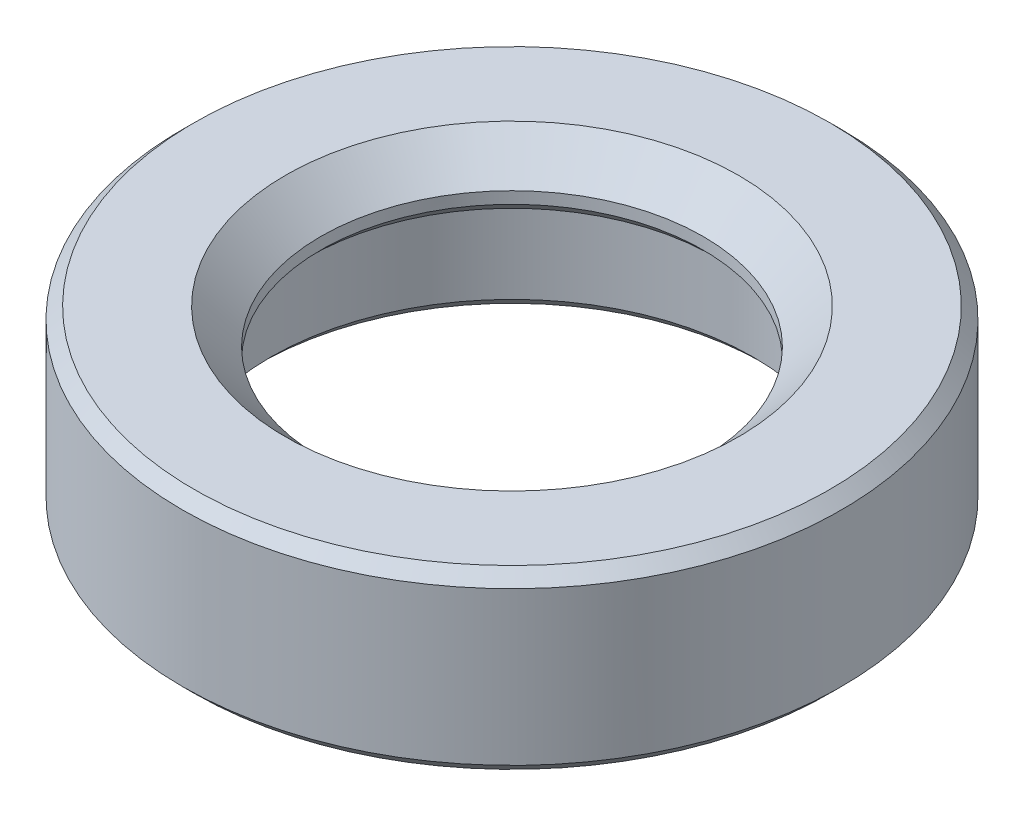
ISO-10303-21;
HEADER;
FILE_DESCRIPTION(('STEP AP214'),'2;1');
FILE_NAME('part.step','',(''),(''),'','','');
FILE_SCHEMA(('AUTOMOTIVE_DESIGN { 1 0 10303 214 1 1 1 1 }'));
ENDSEC;
DATA;
#1=APPLICATION_CONTEXT('core data for automotive mechanical design processes');
#2=APPLICATION_PROTOCOL_DEFINITION('international standard','automotive_design',2000,#1);
#3=PRODUCT_CONTEXT('',#1,'mechanical');
#4=PRODUCT('Part','Part','',(#3));
#5=PRODUCT_RELATED_PRODUCT_CATEGORY('part','',(#4));
#6=PRODUCT_DEFINITION_FORMATION('','',#4);
#7=PRODUCT_DEFINITION_CONTEXT('part definition',#1,'design');
#8=PRODUCT_DEFINITION('design','',#6,#7);
#9=PRODUCT_DEFINITION_SHAPE('','',#8);
#10=(LENGTH_UNIT() NAMED_UNIT(*) SI_UNIT(.MILLI.,.METRE.));
#11=(NAMED_UNIT(*) PLANE_ANGLE_UNIT() SI_UNIT($,.RADIAN.));
#12=(NAMED_UNIT(*) SI_UNIT($,.STERADIAN.) SOLID_ANGLE_UNIT());
#13=UNCERTAINTY_MEASURE_WITH_UNIT(LENGTH_MEASURE(1.E-05),#10,'distance_accuracy_value','');
#14=(GEOMETRIC_REPRESENTATION_CONTEXT(3) GLOBAL_UNCERTAINTY_ASSIGNED_CONTEXT((#13)) GLOBAL_UNIT_ASSIGNED_CONTEXT((#10,
#11,#12)) REPRESENTATION_CONTEXT('',''));
#15=CARTESIAN_POINT('',(0.,0.,0.));
#16=DIRECTION('',(0.,0.,1.));
#17=DIRECTION('',(1.,0.,0.));
#18=AXIS2_PLACEMENT_3D('',#15,#16,#17);
#19=CARTESIAN_POINT('',(0.,-1.5,-5.6));
#20=DIRECTION('',(0.,1.,0.));
#21=DIRECTION('',(0.,0.,1.));
#22=AXIS2_PLACEMENT_3D('',#19,#20,#21);
#23=PLANE('',#22);
#24=CARTESIAN_POINT('',(0.,-1.5,0.));
#25=DIRECTION('',(0.,1.,0.));
#26=DIRECTION('',(0.,0.,1.));
#27=AXIS2_PLACEMENT_3D('',#24,#25,#26);
#28=CIRCLE('',#27,4.3);
#29=CARTESIAN_POINT('',(0.,-1.5,4.3));
#30=VERTEX_POINT('',#29);
#31=EDGE_CURVE('E57',#30,#30,#28,.T.);
#32=ORIENTED_EDGE('',*,*,#31,.T.);
#33=EDGE_LOOP('',(#32));
#34=FACE_BOUND('',#33,.T.);
#35=CARTESIAN_POINT('',(0.,-1.5,0.));
#36=DIRECTION('',(0.,1.,0.));
#37=DIRECTION('',(0.,0.,1.));
#38=AXIS2_PLACEMENT_3D('',#35,#36,#37);
#39=CIRCLE('',#38,5.4);
#40=CARTESIAN_POINT('',(0.,-1.5,5.4));
#41=VERTEX_POINT('',#40);
#42=EDGE_CURVE('E60',#41,#41,#39,.F.);
#43=ORIENTED_EDGE('',*,*,#42,.T.);
#44=EDGE_LOOP('',(#43));
#45=FACE_BOUND('',#44,.T.);
#46=ADVANCED_FACE('F31',(#34,#45),#23,.F.);
#47=CARTESIAN_POINT('',(0.,14.1930379746836,0.));
#48=DIRECTION('',(0.,1.,0.));
#49=DIRECTION('',(0.,0.,1.));
#50=AXIS2_PLACEMENT_3D('',#47,#48,#49);
#51=CYLINDRICAL_SURFACE('',#50,4.1);
#52=CARTESIAN_POINT('',(0.,-1.3,0.));
#53=DIRECTION('',(0.,1.,0.));
#54=DIRECTION('',(0.,0.,1.));
#55=AXIS2_PLACEMENT_3D('',#52,#53,#54);
#56=CIRCLE('',#55,4.1);
#57=CARTESIAN_POINT('',(0.,-1.3,4.1));
#58=VERTEX_POINT('',#57);
#59=EDGE_CURVE('E54',#58,#58,#56,.F.);
#60=ORIENTED_EDGE('',*,*,#59,.T.);
#61=EDGE_LOOP('',(#60));
#62=FACE_BOUND('',#61,.T.);
#63=CARTESIAN_POINT('',(0.,0.5,0.));
#64=DIRECTION('',(0.,1.,0.));
#65=DIRECTION('',(0.,0.,1.));
#66=AXIS2_PLACEMENT_3D('',#63,#64,#65);
#67=CIRCLE('',#66,4.1);
#68=CARTESIAN_POINT('',(0.,0.5,4.1));
#69=VERTEX_POINT('',#68);
#70=EDGE_CURVE('E69',#69,#69,#67,.T.);
#71=ORIENTED_EDGE('',*,*,#70,.T.);
#72=EDGE_LOOP('',(#71));
#73=FACE_BOUND('',#72,.T.);
#74=ADVANCED_FACE('F73',(#62,#73),#51,.F.);
#75=CARTESIAN_POINT('',(0.,0.5,-4.1));
#76=DIRECTION('',(0.,1.,0.));
#77=DIRECTION('',(0.,0.,1.));
#78=AXIS2_PLACEMENT_3D('',#75,#76,#77);
#79=PLANE('',#78);
#80=CARTESIAN_POINT('',(0.,0.5,0.));
#81=DIRECTION('',(0.,1.,0.));
#82=DIRECTION('',(0.,0.,1.));
#83=AXIS2_PLACEMENT_3D('',#80,#81,#82);
#84=CIRCLE('',#83,3.45);
#85=CARTESIAN_POINT('',(0.,0.5,3.45));
#86=VERTEX_POINT('',#85);
#87=EDGE_CURVE('E66',#86,#86,#84,.T.);
#88=ORIENTED_EDGE('',*,*,#87,.T.);
#89=EDGE_LOOP('',(#88));
#90=FACE_BOUND('',#89,.T.);
#91=ORIENTED_EDGE('',*,*,#70,.F.);
#92=EDGE_LOOP('',(#91));
#93=FACE_BOUND('',#92,.T.);
#94=ADVANCED_FACE('F75',(#90,#93),#79,.F.);
#95=CARTESIAN_POINT('',(0.,14.1930379746836,0.));
#96=DIRECTION('',(0.,1.,0.));
#97=DIRECTION('',(0.,0.,1.));
#98=AXIS2_PLACEMENT_3D('',#95,#96,#97);
#99=CYLINDRICAL_SURFACE('',#98,3.25);
#100=CARTESIAN_POINT('',(0.,0.900000000000001,0.));
#101=DIRECTION('',(0.,-1.,0.));
#102=DIRECTION('',(0.,0.,-1.));
#103=AXIS2_PLACEMENT_3D('',#100,#101,#102);
#104=CIRCLE('',#103,3.25);
#105=CARTESIAN_POINT('',(0.,0.900000000000001,-3.25));
#106=VERTEX_POINT('',#105);
#107=EDGE_CURVE('E38',#106,#106,#104,.F.);
#108=ORIENTED_EDGE('',*,*,#107,.T.);
#109=EDGE_LOOP('',(#108));
#110=FACE_BOUND('',#109,.T.);
#111=CARTESIAN_POINT('',(0.,0.699999999999999,0.));
#112=DIRECTION('',(0.,1.,0.));
#113=DIRECTION('',(0.,0.,1.));
#114=AXIS2_PLACEMENT_3D('',#111,#112,#113);
#115=CIRCLE('',#114,3.25);
#116=CARTESIAN_POINT('',(0.,0.699999999999999,3.25));
#117=VERTEX_POINT('',#116);
#118=EDGE_CURVE('E63',#117,#117,#115,.F.);
#119=ORIENTED_EDGE('',*,*,#118,.T.);
#120=EDGE_LOOP('',(#119));
#121=FACE_BOUND('',#120,.T.);
#122=ADVANCED_FACE('F77',(#110,#121),#99,.F.);
#123=CARTESIAN_POINT('',(0.,1.5,-3.25));
#124=DIRECTION('',(0.,-1.,0.));
#125=DIRECTION('',(0.,0.,-1.));
#126=AXIS2_PLACEMENT_3D('',#123,#124,#125);
#127=PLANE('',#126);
#128=CARTESIAN_POINT('',(0.,1.5,0.));
#129=DIRECTION('',(0.,-1.,0.));
#130=DIRECTION('',(0.,0.,-1.));
#131=AXIS2_PLACEMENT_3D('',#128,#129,#130);
#132=CIRCLE('',#131,3.85);
#133=CARTESIAN_POINT('',(0.,1.5,-3.85));
#134=VERTEX_POINT('',#133);
#135=EDGE_CURVE('E10',#134,#134,#132,.T.);
#136=ORIENTED_EDGE('',*,*,#135,.T.);
#137=EDGE_LOOP('',(#136));
#138=FACE_BOUND('',#137,.T.);
#139=CARTESIAN_POINT('',(0.,1.5,0.));
#140=DIRECTION('',(0.,-1.,0.));
#141=DIRECTION('',(0.,0.,-1.));
#142=AXIS2_PLACEMENT_3D('',#139,#140,#141);
#143=CIRCLE('',#142,5.4);
#144=CARTESIAN_POINT('',(0.,1.5,-5.4));
#145=VERTEX_POINT('',#144);
#146=EDGE_CURVE('E42',#145,#145,#143,.F.);
#147=ORIENTED_EDGE('',*,*,#146,.T.);
#148=EDGE_LOOP('',(#147));
#149=FACE_BOUND('',#148,.T.);
#150=ADVANCED_FACE('F84',(#138,#149),#127,.F.);
#151=CARTESIAN_POINT('',(0.,14.1930379746836,0.));
#152=DIRECTION('',(0.,1.,0.));
#153=DIRECTION('',(0.,0.,1.));
#154=AXIS2_PLACEMENT_3D('',#151,#152,#153);
#155=CYLINDRICAL_SURFACE('',#154,5.6);
#156=CARTESIAN_POINT('',(0.,-1.3,0.));
#157=DIRECTION('',(0.,1.,0.));
#158=DIRECTION('',(0.,0.,1.));
#159=AXIS2_PLACEMENT_3D('',#156,#157,#158);
#160=CIRCLE('',#159,5.6);
#161=CARTESIAN_POINT('',(0.,-1.3,5.6));
#162=VERTEX_POINT('',#161);
#163=EDGE_CURVE('E46',#162,#162,#160,.T.);
#164=ORIENTED_EDGE('',*,*,#163,.T.);
#165=EDGE_LOOP('',(#164));
#166=FACE_BOUND('',#165,.T.);
#167=CARTESIAN_POINT('',(0.,1.3,0.));
#168=DIRECTION('',(0.,-1.,0.));
#169=DIRECTION('',(0.,0.,-1.));
#170=AXIS2_PLACEMENT_3D('',#167,#168,#169);
#171=CIRCLE('',#170,5.6);
#172=CARTESIAN_POINT('',(0.,1.3,-5.6));
#173=VERTEX_POINT('',#172);
#174=EDGE_CURVE('E51',#173,#173,#171,.T.);
#175=ORIENTED_EDGE('',*,*,#174,.T.);
#176=EDGE_LOOP('',(#175));
#177=FACE_BOUND('',#176,.T.);
#178=ADVANCED_FACE('F99',(#166,#177),#155,.T.);
#179=CARTESIAN_POINT('',(0.,0.5,0.));
#180=DIRECTION('',(0.,-1.,0.));
#181=DIRECTION('',(0.,0.,-1.));
#182=AXIS2_PLACEMENT_3D('',#179,#180,#181);
#183=CONICAL_SURFACE('',#182,3.45,0.785398163397452);
#184=ORIENTED_EDGE('',*,*,#118,.F.);
#185=EDGE_LOOP('',(#184));
#186=FACE_BOUND('',#185,.T.);
#187=ORIENTED_EDGE('',*,*,#87,.F.);
#188=EDGE_LOOP('',(#187));
#189=FACE_BOUND('',#188,.T.);
#190=ADVANCED_FACE('F95',(#186,#189),#183,.F.);
#191=CARTESIAN_POINT('',(0.,-1.5,0.));
#192=DIRECTION('',(0.,-1.,0.));
#193=DIRECTION('',(0.,0.,-1.));
#194=AXIS2_PLACEMENT_3D('',#191,#192,#193);
#195=CONICAL_SURFACE('',#194,4.3,0.785398163397442);
#196=ORIENTED_EDGE('',*,*,#59,.F.);
#197=EDGE_LOOP('',(#196));
#198=FACE_BOUND('',#197,.T.);
#199=ORIENTED_EDGE('',*,*,#31,.F.);
#200=EDGE_LOOP('',(#199));
#201=FACE_BOUND('',#200,.T.);
#202=ADVANCED_FACE('F98',(#198,#201),#195,.F.);
#203=CARTESIAN_POINT('',(0.,-1.3,0.));
#204=DIRECTION('',(0.,1.,0.));
#205=DIRECTION('',(0.,0.,1.));
#206=AXIS2_PLACEMENT_3D('',#203,#204,#205);
#207=CONICAL_SURFACE('',#206,5.6,0.785398163397444);
#208=ORIENTED_EDGE('',*,*,#42,.F.);
#209=EDGE_LOOP('',(#208));
#210=FACE_BOUND('',#209,.T.);
#211=ORIENTED_EDGE('',*,*,#163,.F.);
#212=EDGE_LOOP('',(#211));
#213=FACE_BOUND('',#212,.T.);
#214=ADVANCED_FACE('F103',(#210,#213),#207,.T.);
#215=CARTESIAN_POINT('',(0.,1.5,0.));
#216=DIRECTION('',(0.,-1.,0.));
#217=DIRECTION('',(0.,0.,-1.));
#218=AXIS2_PLACEMENT_3D('',#215,#216,#217);
#219=CONICAL_SURFACE('',#218,5.4,0.785398163397448);
#220=ORIENTED_EDGE('',*,*,#174,.F.);
#221=EDGE_LOOP('',(#220));
#222=FACE_BOUND('',#221,.T.);
#223=ORIENTED_EDGE('',*,*,#146,.F.);
#224=EDGE_LOOP('',(#223));
#225=FACE_BOUND('',#224,.T.);
#226=ADVANCED_FACE('F106',(#222,#225),#219,.T.);
#227=CARTESIAN_POINT('',(0.,0.900000000000001,0.));
#228=DIRECTION('',(0.,1.,0.));
#229=DIRECTION('',(0.,0.,1.));
#230=AXIS2_PLACEMENT_3D('',#227,#228,#229);
#231=CONICAL_SURFACE('',#230,3.25,0.785398163397449);
#232=ORIENTED_EDGE('',*,*,#135,.F.);
#233=EDGE_LOOP('',(#232));
#234=FACE_BOUND('',#233,.T.);
#235=ORIENTED_EDGE('',*,*,#107,.F.);
#236=EDGE_LOOP('',(#235));
#237=FACE_BOUND('',#236,.T.);
#238=ADVANCED_FACE('F33',(#234,#237),#231,.F.);
#239=CLOSED_SHELL('',(#46,#74,#94,#122,#150,#178,#190,#202,#214,#226,#238));
#240=MANIFOLD_SOLID_BREP('B2',#239);
#241=ADVANCED_BREP_SHAPE_REPRESENTATION('',(#18,#240),#14);
#242=SHAPE_DEFINITION_REPRESENTATION(#9,#241);
ENDSEC;
END-ISO-10303-21;
